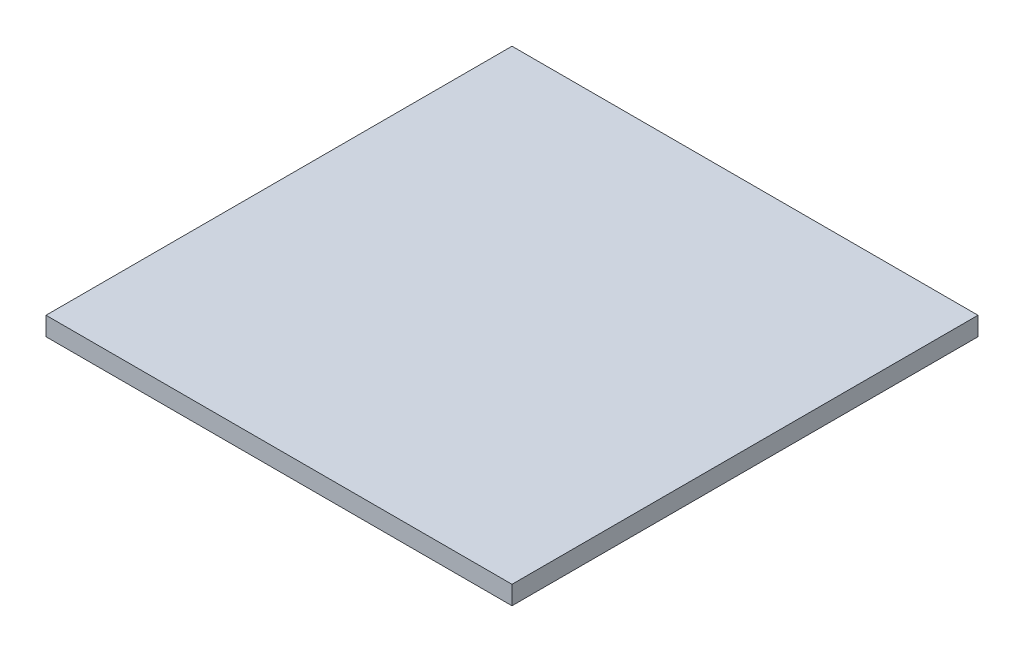
ISO-10303-21;
HEADER;
FILE_DESCRIPTION(('STEP AP214'),'2;1');
FILE_NAME('part.step','',(''),(''),'','','');
FILE_SCHEMA(('AUTOMOTIVE_DESIGN { 1 0 10303 214 1 1 1 1 }'));
ENDSEC;
DATA;
#1=APPLICATION_CONTEXT('core data for automotive mechanical design processes');
#2=APPLICATION_PROTOCOL_DEFINITION('international standard','automotive_design',2000,#1);
#3=PRODUCT_CONTEXT('',#1,'mechanical');
#4=PRODUCT('Part','Part','',(#3));
#5=PRODUCT_RELATED_PRODUCT_CATEGORY('part','',(#4));
#6=PRODUCT_DEFINITION_FORMATION('','',#4);
#7=PRODUCT_DEFINITION_CONTEXT('part definition',#1,'design');
#8=PRODUCT_DEFINITION('design','',#6,#7);
#9=PRODUCT_DEFINITION_SHAPE('','',#8);
#10=(LENGTH_UNIT() NAMED_UNIT(*) SI_UNIT(.MILLI.,.METRE.));
#11=(NAMED_UNIT(*) PLANE_ANGLE_UNIT() SI_UNIT($,.RADIAN.));
#12=(NAMED_UNIT(*) SI_UNIT($,.STERADIAN.) SOLID_ANGLE_UNIT());
#13=UNCERTAINTY_MEASURE_WITH_UNIT(LENGTH_MEASURE(1.E-05),#10,'distance_accuracy_value','');
#14=(GEOMETRIC_REPRESENTATION_CONTEXT(3) GLOBAL_UNCERTAINTY_ASSIGNED_CONTEXT((#13)) GLOBAL_UNIT_ASSIGNED_CONTEXT((#10,
#11,#12)) REPRESENTATION_CONTEXT('',''));
#15=CARTESIAN_POINT('',(0.,0.,0.));
#16=DIRECTION('',(0.,0.,1.));
#17=DIRECTION('',(1.,0.,0.));
#18=AXIS2_PLACEMENT_3D('',#15,#16,#17);
#19=CARTESIAN_POINT('',(25.,2.,25.));
#20=DIRECTION('',(-1.,0.,0.));
#21=DIRECTION('',(0.,0.,1.));
#22=AXIS2_PLACEMENT_3D('',#19,#20,#21);
#23=PLANE('',#22);
#24=DIRECTION('',(0.,0.,-1.));
#25=VECTOR('',#24,1.);
#26=CARTESIAN_POINT('',(25.,0.,25.));
#27=LINE('',#26,#25);
#28=CARTESIAN_POINT('',(25.,0.,25.));
#29=VERTEX_POINT('',#28);
#30=CARTESIAN_POINT('',(25.,0.,-25.));
#31=VERTEX_POINT('',#30);
#32=EDGE_CURVE('E98',#29,#31,#27,.T.);
#33=ORIENTED_EDGE('',*,*,#32,.T.);
#34=DIRECTION('',(0.,-1.,0.));
#35=VECTOR('',#34,1.);
#36=CARTESIAN_POINT('',(25.,2.,-25.));
#37=LINE('',#36,#35);
#38=CARTESIAN_POINT('',(25.,2.,-25.));
#39=VERTEX_POINT('',#38);
#40=EDGE_CURVE('E11',#39,#31,#37,.T.);
#41=ORIENTED_EDGE('',*,*,#40,.F.);
#42=DIRECTION('',(0.,0.,-1.));
#43=VECTOR('',#42,1.);
#44=CARTESIAN_POINT('',(25.,2.,25.));
#45=LINE('',#44,#43);
#46=CARTESIAN_POINT('',(25.,2.,25.));
#47=VERTEX_POINT('',#46);
#48=EDGE_CURVE('E86',#47,#39,#45,.T.);
#49=ORIENTED_EDGE('',*,*,#48,.F.);
#50=DIRECTION('',(0.,-1.,0.));
#51=VECTOR('',#50,1.);
#52=CARTESIAN_POINT('',(25.,2.,25.));
#53=LINE('',#52,#51);
#54=EDGE_CURVE('E94',#47,#29,#53,.T.);
#55=ORIENTED_EDGE('',*,*,#54,.T.);
#56=EDGE_LOOP('',(#33,#41,#49,#55));
#57=FACE_BOUND('',#56,.T.);
#58=ADVANCED_FACE('F35',(#57),#23,.F.);
#59=CARTESIAN_POINT('',(-25.,2.,-25.));
#60=DIRECTION('',(0.,0.,1.));
#61=DIRECTION('',(1.,0.,0.));
#62=AXIS2_PLACEMENT_3D('',#59,#60,#61);
#63=PLANE('',#62);
#64=DIRECTION('',(-1.,0.,0.));
#65=VECTOR('',#64,1.);
#66=CARTESIAN_POINT('',(-25.,0.,-25.));
#67=LINE('',#66,#65);
#68=CARTESIAN_POINT('',(-25.,0.,-25.));
#69=VERTEX_POINT('',#68);
#70=EDGE_CURVE('E90',#31,#69,#67,.T.);
#71=ORIENTED_EDGE('',*,*,#70,.T.);
#72=DIRECTION('',(0.,-1.,0.));
#73=VECTOR('',#72,1.);
#74=CARTESIAN_POINT('',(-25.,2.,-25.));
#75=LINE('',#74,#73);
#76=CARTESIAN_POINT('',(-25.,2.,-25.));
#77=VERTEX_POINT('',#76);
#78=EDGE_CURVE('E43',#77,#69,#75,.T.);
#79=ORIENTED_EDGE('',*,*,#78,.F.);
#80=DIRECTION('',(-1.,0.,0.));
#81=VECTOR('',#80,1.);
#82=CARTESIAN_POINT('',(-25.,2.,-25.));
#83=LINE('',#82,#81);
#84=EDGE_CURVE('E81',#39,#77,#83,.T.);
#85=ORIENTED_EDGE('',*,*,#84,.F.);
#86=ORIENTED_EDGE('',*,*,#40,.T.);
#87=EDGE_LOOP('',(#71,#79,#85,#86));
#88=FACE_BOUND('',#87,.T.);
#89=ADVANCED_FACE('F89',(#88),#63,.F.);
#90=CARTESIAN_POINT('',(-25.,2.,25.));
#91=DIRECTION('',(1.,0.,0.));
#92=DIRECTION('',(0.,0.,-1.));
#93=AXIS2_PLACEMENT_3D('',#90,#91,#92);
#94=PLANE('',#93);
#95=DIRECTION('',(0.,0.,1.));
#96=VECTOR('',#95,1.);
#97=CARTESIAN_POINT('',(-25.,0.,25.));
#98=LINE('',#97,#96);
#99=CARTESIAN_POINT('',(-25.,0.,25.));
#100=VERTEX_POINT('',#99);
#101=EDGE_CURVE('E68',#69,#100,#98,.T.);
#102=ORIENTED_EDGE('',*,*,#101,.T.);
#103=DIRECTION('',(0.,-1.,0.));
#104=VECTOR('',#103,1.);
#105=CARTESIAN_POINT('',(-25.,2.,25.));
#106=LINE('',#105,#104);
#107=CARTESIAN_POINT('',(-25.,2.,25.));
#108=VERTEX_POINT('',#107);
#109=EDGE_CURVE('E91',#108,#100,#106,.T.);
#110=ORIENTED_EDGE('',*,*,#109,.F.);
#111=DIRECTION('',(0.,0.,1.));
#112=VECTOR('',#111,1.);
#113=CARTESIAN_POINT('',(-25.,2.,25.));
#114=LINE('',#113,#112);
#115=EDGE_CURVE('E84',#77,#108,#114,.T.);
#116=ORIENTED_EDGE('',*,*,#115,.F.);
#117=ORIENTED_EDGE('',*,*,#78,.T.);
#118=EDGE_LOOP('',(#102,#110,#116,#117));
#119=FACE_BOUND('',#118,.T.);
#120=ADVANCED_FACE('F92',(#119),#94,.F.);
#121=CARTESIAN_POINT('',(-25.,2.,25.));
#122=DIRECTION('',(0.,0.,-1.));
#123=DIRECTION('',(-1.,0.,0.));
#124=AXIS2_PLACEMENT_3D('',#121,#122,#123);
#125=PLANE('',#124);
#126=DIRECTION('',(1.,0.,0.));
#127=VECTOR('',#126,1.);
#128=CARTESIAN_POINT('',(-25.,0.,25.));
#129=LINE('',#128,#127);
#130=EDGE_CURVE('E74',#100,#29,#129,.T.);
#131=ORIENTED_EDGE('',*,*,#130,.T.);
#132=ORIENTED_EDGE('',*,*,#54,.F.);
#133=DIRECTION('',(1.,0.,0.));
#134=VECTOR('',#133,1.);
#135=CARTESIAN_POINT('',(-25.,2.,25.));
#136=LINE('',#135,#134);
#137=EDGE_CURVE('E51',#108,#47,#136,.T.);
#138=ORIENTED_EDGE('',*,*,#137,.F.);
#139=ORIENTED_EDGE('',*,*,#109,.T.);
#140=EDGE_LOOP('',(#131,#132,#138,#139));
#141=FACE_BOUND('',#140,.T.);
#142=ADVANCED_FACE('F105',(#141),#125,.F.);
#143=CARTESIAN_POINT('',(0.,2.,0.));
#144=DIRECTION('',(0.,-1.,0.));
#145=DIRECTION('',(0.,0.,-1.));
#146=AXIS2_PLACEMENT_3D('',#143,#144,#145);
#147=PLANE('',#146);
#148=ORIENTED_EDGE('',*,*,#48,.T.);
#149=ORIENTED_EDGE('',*,*,#84,.T.);
#150=ORIENTED_EDGE('',*,*,#115,.T.);
#151=ORIENTED_EDGE('',*,*,#137,.T.);
#152=EDGE_LOOP('',(#148,#149,#150,#151));
#153=FACE_BOUND('',#152,.T.);
#154=ADVANCED_FACE('F82',(#153),#147,.F.);
#155=CARTESIAN_POINT('',(0.,0.,0.));
#156=DIRECTION('',(0.,-1.,0.));
#157=DIRECTION('',(0.,0.,-1.));
#158=AXIS2_PLACEMENT_3D('',#155,#156,#157);
#159=PLANE('',#158);
#160=ORIENTED_EDGE('',*,*,#32,.F.);
#161=ORIENTED_EDGE('',*,*,#130,.F.);
#162=ORIENTED_EDGE('',*,*,#101,.F.);
#163=ORIENTED_EDGE('',*,*,#70,.F.);
#164=EDGE_LOOP('',(#160,#161,#162,#163));
#165=FACE_BOUND('',#164,.T.);
#166=ADVANCED_FACE('F108',(#165),#159,.T.);
#167=CLOSED_SHELL('',(#58,#89,#120,#142,#154,#166));
#168=MANIFOLD_SOLID_BREP('B2',#167);
#169=ADVANCED_BREP_SHAPE_REPRESENTATION('',(#18,#168),#14);
#170=SHAPE_DEFINITION_REPRESENTATION(#9,#169);
ENDSEC;
END-ISO-10303-21;
